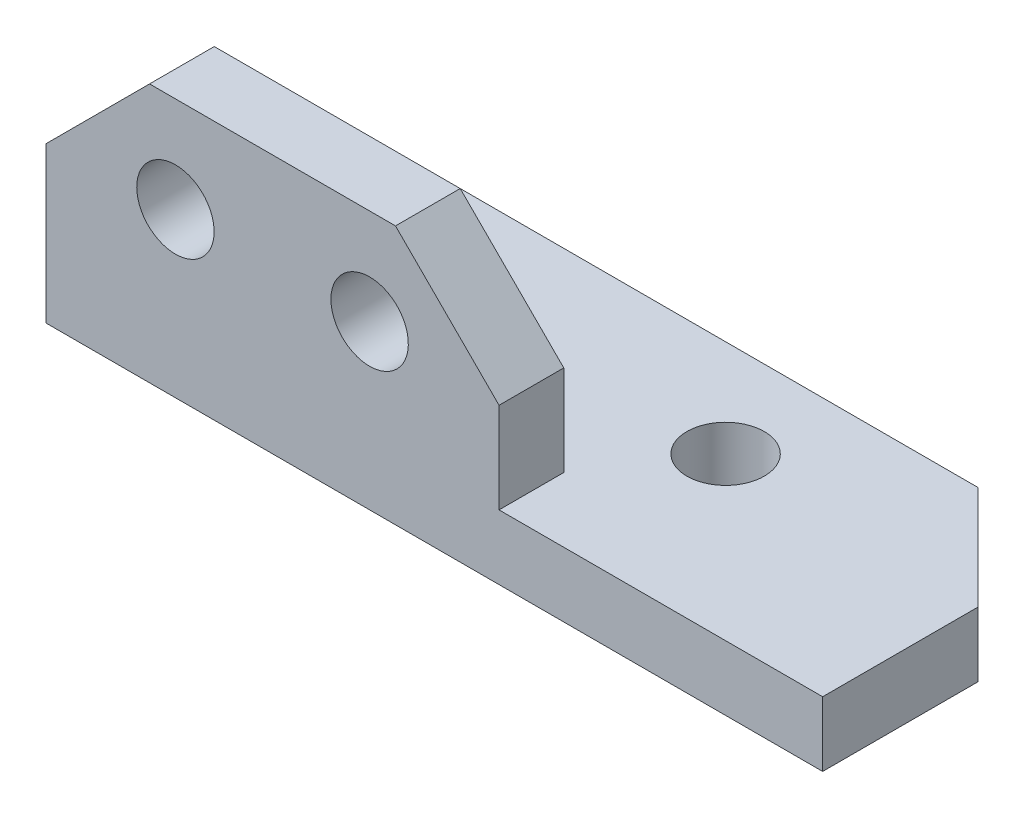
ISO-10303-21;
HEADER;
FILE_DESCRIPTION(('STEP AP214'),'2;1');
FILE_NAME('part.step','',(''),(''),'','','');
FILE_SCHEMA(('AUTOMOTIVE_DESIGN { 1 0 10303 214 1 1 1 1 }'));
ENDSEC;
DATA;
#1=APPLICATION_CONTEXT('core data for automotive mechanical design processes');
#2=APPLICATION_PROTOCOL_DEFINITION('international standard','automotive_design',2000,#1);
#3=PRODUCT_CONTEXT('',#1,'mechanical');
#4=PRODUCT('Part','Part','',(#3));
#5=PRODUCT_RELATED_PRODUCT_CATEGORY('part','',(#4));
#6=PRODUCT_DEFINITION_FORMATION('','',#4);
#7=PRODUCT_DEFINITION_CONTEXT('part definition',#1,'design');
#8=PRODUCT_DEFINITION('design','',#6,#7);
#9=PRODUCT_DEFINITION_SHAPE('','',#8);
#10=(LENGTH_UNIT() NAMED_UNIT(*) SI_UNIT(.MILLI.,.METRE.));
#11=(NAMED_UNIT(*) PLANE_ANGLE_UNIT() SI_UNIT($,.RADIAN.));
#12=(NAMED_UNIT(*) SI_UNIT($,.STERADIAN.) SOLID_ANGLE_UNIT());
#13=UNCERTAINTY_MEASURE_WITH_UNIT(LENGTH_MEASURE(1.E-05),#10,'distance_accuracy_value','');
#14=(GEOMETRIC_REPRESENTATION_CONTEXT(3) GLOBAL_UNCERTAINTY_ASSIGNED_CONTEXT((#13)) GLOBAL_UNIT_ASSIGNED_CONTEXT((#10,
#11,#12)) REPRESENTATION_CONTEXT('',''));
#15=CARTESIAN_POINT('',(0.,0.,0.));
#16=DIRECTION('',(0.,0.,1.));
#17=DIRECTION('',(1.,0.,0.));
#18=AXIS2_PLACEMENT_3D('',#15,#16,#17);
#19=CARTESIAN_POINT('',(19.05,9.525,0.));
#20=DIRECTION('',(0.,-1.,0.));
#21=DIRECTION('',(0.,0.,-1.));
#22=AXIS2_PLACEMENT_3D('',#19,#20,#21);
#23=PLANE('',#22);
#24=DIRECTION('',(-1.,0.,0.));
#25=VECTOR('',#24,1.);
#26=CARTESIAN_POINT('',(19.05,9.525,0.));
#27=LINE('',#26,#25);
#28=CARTESIAN_POINT('',(-1.905,9.525,0.));
#29=VERTEX_POINT('',#28);
#30=CARTESIAN_POINT('',(-13.97,9.525,0.));
#31=VERTEX_POINT('',#30);
#32=EDGE_CURVE('E135',#29,#31,#27,.T.);
#33=ORIENTED_EDGE('',*,*,#32,.T.);
#34=DIRECTION('',(0.,0.,1.));
#35=VECTOR('',#34,1.);
#36=CARTESIAN_POINT('',(-13.97,9.525,3.175));
#37=LINE('',#36,#35);
#38=CARTESIAN_POINT('',(-13.97,9.525,3.175));
#39=VERTEX_POINT('',#38);
#40=EDGE_CURVE('E181',#31,#39,#37,.T.);
#41=ORIENTED_EDGE('',*,*,#40,.T.);
#42=DIRECTION('',(-1.,0.,0.));
#43=VECTOR('',#42,1.);
#44=CARTESIAN_POINT('',(19.05,9.525,3.175));
#45=LINE('',#44,#43);
#46=CARTESIAN_POINT('',(-1.905,9.525,3.175));
#47=VERTEX_POINT('',#46);
#48=EDGE_CURVE('E150',#47,#39,#45,.T.);
#49=ORIENTED_EDGE('',*,*,#48,.F.);
#50=DIRECTION('',(0.,0.,-1.));
#51=VECTOR('',#50,1.);
#52=CARTESIAN_POINT('',(-1.905,9.525,0.));
#53=LINE('',#52,#51);
#54=EDGE_CURVE('E178',#47,#29,#53,.T.);
#55=ORIENTED_EDGE('',*,*,#54,.T.);
#56=EDGE_LOOP('',(#33,#41,#49,#55));
#57=FACE_BOUND('',#56,.T.);
#58=ADVANCED_FACE('F34',(#57),#23,.F.);
#59=CARTESIAN_POINT('',(19.05,9.525,3.175));
#60=DIRECTION('',(0.,0.,-1.));
#61=DIRECTION('',(0.,1.,0.));
#62=AXIS2_PLACEMENT_3D('',#59,#60,#61);
#63=PLANE('',#62);
#64=CARTESIAN_POINT('',(-12.7,4.826,3.175));
#65=DIRECTION('',(0.,0.,-1.));
#66=DIRECTION('',(0.,1.,0.));
#67=AXIS2_PLACEMENT_3D('',#64,#65,#66);
#68=CIRCLE('',#67,1.89865);
#69=CARTESIAN_POINT('',(-12.7,6.72465,3.175));
#70=VERTEX_POINT('',#69);
#71=EDGE_CURVE('E337',#70,#70,#68,.T.);
#72=ORIENTED_EDGE('',*,*,#71,.T.);
#73=EDGE_LOOP('',(#72));
#74=FACE_BOUND('',#73,.T.);
#75=CARTESIAN_POINT('',(-3.175,4.826,3.175));
#76=DIRECTION('',(0.,0.,-1.));
#77=DIRECTION('',(0.,1.,0.));
#78=AXIS2_PLACEMENT_3D('',#75,#76,#77);
#79=CIRCLE('',#78,1.89865);
#80=CARTESIAN_POINT('',(-3.175,6.72465,3.175));
#81=VERTEX_POINT('',#80);
#82=EDGE_CURVE('E154',#81,#81,#79,.T.);
#83=ORIENTED_EDGE('',*,*,#82,.T.);
#84=EDGE_LOOP('',(#83));
#85=FACE_BOUND('',#84,.T.);
#86=ORIENTED_EDGE('',*,*,#48,.T.);
#87=DIRECTION('',(-0.707106781186546,-0.707106781186549,0.));
#88=VECTOR('',#87,1.);
#89=CARTESIAN_POINT('',(-13.97,9.525,3.175));
#90=LINE('',#89,#88);
#91=CARTESIAN_POINT('',(-19.05,4.44499999999999,3.175));
#92=VERTEX_POINT('',#91);
#93=EDGE_CURVE('E186',#39,#92,#90,.T.);
#94=ORIENTED_EDGE('',*,*,#93,.T.);
#95=DIRECTION('',(0.,-1.,0.));
#96=VECTOR('',#95,1.);
#97=CARTESIAN_POINT('',(-19.05,9.525,3.175));
#98=LINE('',#97,#96);
#99=CARTESIAN_POINT('',(-19.05,-3.175,3.175));
#100=VERTEX_POINT('',#99);
#101=EDGE_CURVE('E157',#92,#100,#98,.T.);
#102=ORIENTED_EDGE('',*,*,#101,.T.);
#103=DIRECTION('',(-1.,0.,0.));
#104=VECTOR('',#103,1.);
#105=CARTESIAN_POINT('',(19.05,-3.175,3.175));
#106=LINE('',#105,#104);
#107=CARTESIAN_POINT('',(19.05,-3.175,3.175));
#108=VERTEX_POINT('',#107);
#109=EDGE_CURVE('E147',#108,#100,#106,.T.);
#110=ORIENTED_EDGE('',*,*,#109,.F.);
#111=DIRECTION('',(0.,-1.,0.));
#112=VECTOR('',#111,1.);
#113=CARTESIAN_POINT('',(19.05,9.525,3.175));
#114=LINE('',#113,#112);
#115=CARTESIAN_POINT('',(19.05,0.,3.175));
#116=VERTEX_POINT('',#115);
#117=EDGE_CURVE('E213',#116,#108,#114,.T.);
#118=ORIENTED_EDGE('',*,*,#117,.F.);
#119=DIRECTION('',(-1.,0.,0.));
#120=VECTOR('',#119,1.);
#121=CARTESIAN_POINT('',(19.05,0.,3.175));
#122=LINE('',#121,#120);
#123=CARTESIAN_POINT('',(3.175,0.,3.175));
#124=VERTEX_POINT('',#123);
#125=EDGE_CURVE('E128',#116,#124,#122,.T.);
#126=ORIENTED_EDGE('',*,*,#125,.T.);
#127=DIRECTION('',(0.,1.,0.));
#128=VECTOR('',#127,1.);
#129=CARTESIAN_POINT('',(3.175,9.525,3.175));
#130=LINE('',#129,#128);
#131=CARTESIAN_POINT('',(3.175,4.44499999999999,3.175));
#132=VERTEX_POINT('',#131);
#133=EDGE_CURVE('E116',#124,#132,#130,.T.);
#134=ORIENTED_EDGE('',*,*,#133,.T.);
#135=DIRECTION('',(0.707106781186546,-0.707106781186549,0.));
#136=VECTOR('',#135,1.);
#137=CARTESIAN_POINT('',(-1.905,9.525,3.175));
#138=LINE('',#137,#136);
#139=EDGE_CURVE('E184',#132,#47,#138,.F.);
#140=ORIENTED_EDGE('',*,*,#139,.T.);
#141=EDGE_LOOP('',(#86,#94,#102,#110,#118,#126,#134,#140));
#142=FACE_BOUND('',#141,.T.);
#143=ADVANCED_FACE('F199',(#74,#85,#142),#63,.F.);
#144=CARTESIAN_POINT('',(19.05,-3.175,3.175));
#145=DIRECTION('',(0.,1.,0.));
#146=DIRECTION('',(0.,0.,1.));
#147=AXIS2_PLACEMENT_3D('',#144,#145,#146);
#148=PLANE('',#147);
#149=CARTESIAN_POINT('',(6.35,-3.175,-4.7625));
#150=DIRECTION('',(0.,1.,0.));
#151=DIRECTION('',(0.,0.,1.));
#152=AXIS2_PLACEMENT_3D('',#149,#150,#151);
#153=CIRCLE('',#152,1.89865);
#154=CARTESIAN_POINT('',(6.35,-3.175,-2.86385));
#155=VERTEX_POINT('',#154);
#156=EDGE_CURVE('E326',#155,#155,#153,.T.);
#157=ORIENTED_EDGE('',*,*,#156,.T.);
#158=EDGE_LOOP('',(#157));
#159=FACE_BOUND('',#158,.T.);
#160=CARTESIAN_POINT('',(-6.35,-3.175,-4.7625));
#161=DIRECTION('',(0.,1.,0.));
#162=DIRECTION('',(0.,0.,1.));
#163=AXIS2_PLACEMENT_3D('',#160,#161,#162);
#164=CIRCLE('',#163,1.89865);
#165=CARTESIAN_POINT('',(-6.35,-3.175,-2.86385));
#166=VERTEX_POINT('',#165);
#167=EDGE_CURVE('E332',#166,#166,#164,.T.);
#168=ORIENTED_EDGE('',*,*,#167,.T.);
#169=EDGE_LOOP('',(#168));
#170=FACE_BOUND('',#169,.T.);
#171=DIRECTION('',(-1.,0.,0.));
#172=VECTOR('',#171,1.);
#173=CARTESIAN_POINT('',(19.05,-3.175,-9.525));
#174=LINE('',#173,#172);
#175=CARTESIAN_POINT('',(13.97,-3.175,-9.525));
#176=VERTEX_POINT('',#175);
#177=CARTESIAN_POINT('',(-13.97,-3.175,-9.525));
#178=VERTEX_POINT('',#177);
#179=EDGE_CURVE('E138',#176,#178,#174,.T.);
#180=ORIENTED_EDGE('',*,*,#179,.F.);
#181=DIRECTION('',(-0.707106781186549,0.,-0.707106781186546));
#182=VECTOR('',#181,1.);
#183=CARTESIAN_POINT('',(19.05,-3.175,-4.44500000000001));
#184=LINE('',#183,#182);
#185=CARTESIAN_POINT('',(19.05,-3.175,-4.44500000000001));
#186=VERTEX_POINT('',#185);
#187=EDGE_CURVE('E172',#176,#186,#184,.F.);
#188=ORIENTED_EDGE('',*,*,#187,.T.);
#189=DIRECTION('',(0.,0.,-1.));
#190=VECTOR('',#189,1.);
#191=CARTESIAN_POINT('',(19.05,-3.175,3.175));
#192=LINE('',#191,#190);
#193=EDGE_CURVE('E215',#108,#186,#192,.T.);
#194=ORIENTED_EDGE('',*,*,#193,.F.);
#195=ORIENTED_EDGE('',*,*,#109,.T.);
#196=DIRECTION('',(0.,0.,-1.));
#197=VECTOR('',#196,1.);
#198=CARTESIAN_POINT('',(-19.05,-3.175,3.175));
#199=LINE('',#198,#197);
#200=CARTESIAN_POINT('',(-19.05,-3.175,-4.44499999999999));
#201=VERTEX_POINT('',#200);
#202=EDGE_CURVE('E205',#100,#201,#199,.T.);
#203=ORIENTED_EDGE('',*,*,#202,.T.);
#204=DIRECTION('',(0.707106781186546,0.,-0.707106781186549));
#205=VECTOR('',#204,1.);
#206=CARTESIAN_POINT('',(-13.97,-3.175,-9.525));
#207=LINE('',#206,#205);
#208=EDGE_CURVE('E170',#201,#178,#207,.T.);
#209=ORIENTED_EDGE('',*,*,#208,.T.);
#210=EDGE_LOOP('',(#180,#188,#194,#195,#203,#209));
#211=FACE_BOUND('',#210,.T.);
#212=ADVANCED_FACE('F225',(#159,#170,#211),#148,.F.);
#213=CARTESIAN_POINT('',(19.05,-3.175,-9.525));
#214=DIRECTION('',(0.,0.,1.));
#215=DIRECTION('',(1.,0.,0.));
#216=AXIS2_PLACEMENT_3D('',#213,#214,#215);
#217=PLANE('',#216);
#218=DIRECTION('',(-1.,0.,0.));
#219=VECTOR('',#218,1.);
#220=CARTESIAN_POINT('',(19.05,0.,-9.525));
#221=LINE('',#220,#219);
#222=CARTESIAN_POINT('',(13.97,0.,-9.525));
#223=VERTEX_POINT('',#222);
#224=CARTESIAN_POINT('',(-13.97,0.,-9.525));
#225=VERTEX_POINT('',#224);
#226=EDGE_CURVE('E134',#223,#225,#221,.T.);
#227=ORIENTED_EDGE('',*,*,#226,.F.);
#228=DIRECTION('',(0.,-1.,0.));
#229=VECTOR('',#228,1.);
#230=CARTESIAN_POINT('',(13.97,-3.175,-9.525));
#231=LINE('',#230,#229);
#232=EDGE_CURVE('E168',#223,#176,#231,.T.);
#233=ORIENTED_EDGE('',*,*,#232,.T.);
#234=ORIENTED_EDGE('',*,*,#179,.T.);
#235=DIRECTION('',(0.,1.,0.));
#236=VECTOR('',#235,1.);
#237=CARTESIAN_POINT('',(-13.97,0.,-9.525));
#238=LINE('',#237,#236);
#239=EDGE_CURVE('E165',#178,#225,#238,.T.);
#240=ORIENTED_EDGE('',*,*,#239,.T.);
#241=EDGE_LOOP('',(#227,#233,#234,#240));
#242=FACE_BOUND('',#241,.T.);
#243=ADVANCED_FACE('F232',(#242),#217,.F.);
#244=CARTESIAN_POINT('',(19.05,0.,-9.525));
#245=DIRECTION('',(0.,-1.,0.));
#246=DIRECTION('',(0.,0.,-1.));
#247=AXIS2_PLACEMENT_3D('',#244,#245,#246);
#248=PLANE('',#247);
#249=CARTESIAN_POINT('',(6.35,0.,-4.7625));
#250=DIRECTION('',(0.,1.,0.));
#251=DIRECTION('',(0.,0.,1.));
#252=AXIS2_PLACEMENT_3D('',#249,#250,#251);
#253=CIRCLE('',#252,1.89865);
#254=CARTESIAN_POINT('',(6.35,0.,-2.86385));
#255=VERTEX_POINT('',#254);
#256=EDGE_CURVE('E121',#255,#255,#253,.T.);
#257=ORIENTED_EDGE('',*,*,#256,.F.);
#258=EDGE_LOOP('',(#257));
#259=FACE_BOUND('',#258,.T.);
#260=CARTESIAN_POINT('',(-6.35,0.,-4.7625));
#261=DIRECTION('',(0.,1.,0.));
#262=DIRECTION('',(0.,0.,1.));
#263=AXIS2_PLACEMENT_3D('',#260,#261,#262);
#264=CIRCLE('',#263,1.89865);
#265=CARTESIAN_POINT('',(-6.35,0.,-2.86385));
#266=VERTEX_POINT('',#265);
#267=EDGE_CURVE('E329',#266,#266,#264,.T.);
#268=ORIENTED_EDGE('',*,*,#267,.F.);
#269=EDGE_LOOP('',(#268));
#270=FACE_BOUND('',#269,.T.);
#271=DIRECTION('',(0.,0.,1.));
#272=VECTOR('',#271,1.);
#273=CARTESIAN_POINT('',(19.05,0.,-9.525));
#274=LINE('',#273,#272);
#275=CARTESIAN_POINT('',(19.05,0.,-4.44500000000001));
#276=VERTEX_POINT('',#275);
#277=EDGE_CURVE('E141',#276,#116,#274,.T.);
#278=ORIENTED_EDGE('',*,*,#277,.F.);
#279=DIRECTION('',(0.707106781186549,0.,0.707106781186546));
#280=VECTOR('',#279,1.);
#281=CARTESIAN_POINT('',(19.05,0.,-4.44500000000001));
#282=LINE('',#281,#280);
#283=EDGE_CURVE('E163',#276,#223,#282,.F.);
#284=ORIENTED_EDGE('',*,*,#283,.T.);
#285=ORIENTED_EDGE('',*,*,#226,.T.);
#286=DIRECTION('',(-0.707106781186546,0.,0.707106781186549));
#287=VECTOR('',#286,1.);
#288=CARTESIAN_POINT('',(-13.97,0.,-9.525));
#289=LINE('',#288,#287);
#290=CARTESIAN_POINT('',(-19.05,0.,-4.44499999999999));
#291=VERTEX_POINT('',#290);
#292=EDGE_CURVE('E161',#225,#291,#289,.T.);
#293=ORIENTED_EDGE('',*,*,#292,.T.);
#294=DIRECTION('',(0.,0.,1.));
#295=VECTOR('',#294,1.);
#296=CARTESIAN_POINT('',(-19.05,0.,-9.525));
#297=LINE('',#296,#295);
#298=CARTESIAN_POINT('',(-19.05,0.,0.));
#299=VERTEX_POINT('',#298);
#300=EDGE_CURVE('E133',#291,#299,#297,.T.);
#301=ORIENTED_EDGE('',*,*,#300,.T.);
#302=DIRECTION('',(-1.,0.,0.));
#303=VECTOR('',#302,1.);
#304=CARTESIAN_POINT('',(19.05,0.,0.));
#305=LINE('',#304,#303);
#306=CARTESIAN_POINT('',(3.175,0.,0.));
#307=VERTEX_POINT('',#306);
#308=EDGE_CURVE('E126',#307,#299,#305,.T.);
#309=ORIENTED_EDGE('',*,*,#308,.F.);
#310=DIRECTION('',(0.,0.,-1.));
#311=VECTOR('',#310,1.);
#312=CARTESIAN_POINT('',(3.175,0.,3.175));
#313=LINE('',#312,#311);
#314=EDGE_CURVE('E113',#124,#307,#313,.T.);
#315=ORIENTED_EDGE('',*,*,#314,.F.);
#316=ORIENTED_EDGE('',*,*,#125,.F.);
#317=EDGE_LOOP('',(#278,#284,#285,#293,#301,#309,#315,#316));
#318=FACE_BOUND('',#317,.T.);
#319=ADVANCED_FACE('F131',(#259,#270,#318),#248,.F.);
#320=CARTESIAN_POINT('',(19.05,0.,0.));
#321=DIRECTION('',(0.,0.,1.));
#322=DIRECTION('',(1.,0.,0.));
#323=AXIS2_PLACEMENT_3D('',#320,#321,#322);
#324=PLANE('',#323);
#325=CARTESIAN_POINT('',(-12.7,4.826,0.));
#326=DIRECTION('',(0.,0.,-1.));
#327=DIRECTION('',(-1.,0.,0.));
#328=AXIS2_PLACEMENT_3D('',#325,#326,#327);
#329=CIRCLE('',#328,1.89865);
#330=CARTESIAN_POINT('',(-14.59865,4.826,0.));
#331=VERTEX_POINT('',#330);
#332=EDGE_CURVE('E335',#331,#331,#329,.T.);
#333=ORIENTED_EDGE('',*,*,#332,.F.);
#334=EDGE_LOOP('',(#333));
#335=FACE_BOUND('',#334,.T.);
#336=CARTESIAN_POINT('',(-3.175,4.826,0.));
#337=DIRECTION('',(0.,0.,-1.));
#338=DIRECTION('',(-1.,0.,0.));
#339=AXIS2_PLACEMENT_3D('',#336,#337,#338);
#340=CIRCLE('',#339,1.89865);
#341=CARTESIAN_POINT('',(-5.07365,4.826,0.));
#342=VERTEX_POINT('',#341);
#343=EDGE_CURVE('E158',#342,#342,#340,.T.);
#344=ORIENTED_EDGE('',*,*,#343,.F.);
#345=EDGE_LOOP('',(#344));
#346=FACE_BOUND('',#345,.T.);
#347=DIRECTION('',(0.,1.,0.));
#348=VECTOR('',#347,1.);
#349=CARTESIAN_POINT('',(-19.05,0.,0.));
#350=LINE('',#349,#348);
#351=CARTESIAN_POINT('',(-19.05,4.44499999999999,0.));
#352=VERTEX_POINT('',#351);
#353=EDGE_CURVE('E189',#299,#352,#350,.T.);
#354=ORIENTED_EDGE('',*,*,#353,.T.);
#355=DIRECTION('',(0.707106781186546,0.707106781186549,0.));
#356=VECTOR('',#355,1.);
#357=CARTESIAN_POINT('',(-13.97,9.525,0.));
#358=LINE('',#357,#356);
#359=EDGE_CURVE('E41',#352,#31,#358,.T.);
#360=ORIENTED_EDGE('',*,*,#359,.T.);
#361=ORIENTED_EDGE('',*,*,#32,.F.);
#362=DIRECTION('',(-0.707106781186546,0.707106781186549,0.));
#363=VECTOR('',#362,1.);
#364=CARTESIAN_POINT('',(-1.905,9.525,0.));
#365=LINE('',#364,#363);
#366=CARTESIAN_POINT('',(3.175,4.44499999999999,0.));
#367=VERTEX_POINT('',#366);
#368=EDGE_CURVE('E48',#29,#367,#365,.F.);
#369=ORIENTED_EDGE('',*,*,#368,.T.);
#370=DIRECTION('',(0.,1.,0.));
#371=VECTOR('',#370,1.);
#372=CARTESIAN_POINT('',(3.175,9.525,0.));
#373=LINE('',#372,#371);
#374=EDGE_CURVE('E115',#307,#367,#373,.T.);
#375=ORIENTED_EDGE('',*,*,#374,.F.);
#376=ORIENTED_EDGE('',*,*,#308,.T.);
#377=EDGE_LOOP('',(#354,#360,#361,#369,#375,#376));
#378=FACE_BOUND('',#377,.T.);
#379=ADVANCED_FACE('F125',(#335,#346,#378),#324,.F.);
#380=CARTESIAN_POINT('',(19.05,9.525,-9.525));
#381=DIRECTION('',(-1.,0.,0.));
#382=DIRECTION('',(0.,0.,1.));
#383=AXIS2_PLACEMENT_3D('',#380,#381,#382);
#384=PLANE('',#383);
#385=ORIENTED_EDGE('',*,*,#193,.T.);
#386=DIRECTION('',(0.,1.,0.));
#387=VECTOR('',#386,1.);
#388=CARTESIAN_POINT('',(19.05,9.525,-4.44500000000001));
#389=LINE('',#388,#387);
#390=EDGE_CURVE('E153',#186,#276,#389,.T.);
#391=ORIENTED_EDGE('',*,*,#390,.T.);
#392=ORIENTED_EDGE('',*,*,#277,.T.);
#393=ORIENTED_EDGE('',*,*,#117,.T.);
#394=EDGE_LOOP('',(#385,#391,#392,#393));
#395=FACE_BOUND('',#394,.T.);
#396=ADVANCED_FACE('F218',(#395),#384,.F.);
#397=CARTESIAN_POINT('',(-19.05,9.525,-9.525));
#398=DIRECTION('',(-1.,0.,0.));
#399=DIRECTION('',(0.,0.,1.));
#400=AXIS2_PLACEMENT_3D('',#397,#398,#399);
#401=PLANE('',#400);
#402=ORIENTED_EDGE('',*,*,#300,.F.);
#403=DIRECTION('',(0.,-1.,0.));
#404=VECTOR('',#403,1.);
#405=CARTESIAN_POINT('',(-19.05,-3.175,-4.44499999999999));
#406=LINE('',#405,#404);
#407=EDGE_CURVE('E176',#291,#201,#406,.T.);
#408=ORIENTED_EDGE('',*,*,#407,.T.);
#409=ORIENTED_EDGE('',*,*,#202,.F.);
#410=ORIENTED_EDGE('',*,*,#101,.F.);
#411=DIRECTION('',(0.,0.,-1.));
#412=VECTOR('',#411,1.);
#413=CARTESIAN_POINT('',(-19.05,4.44499999999999,0.));
#414=LINE('',#413,#412);
#415=EDGE_CURVE('E174',#92,#352,#414,.T.);
#416=ORIENTED_EDGE('',*,*,#415,.T.);
#417=ORIENTED_EDGE('',*,*,#353,.F.);
#418=EDGE_LOOP('',(#402,#408,#409,#410,#416,#417));
#419=FACE_BOUND('',#418,.T.);
#420=ADVANCED_FACE('F203',(#419),#401,.T.);
#421=CARTESIAN_POINT('',(-3.175,4.826,0.));
#422=DIRECTION('',(0.,0.,-1.));
#423=DIRECTION('',(-1.,0.,0.));
#424=AXIS2_PLACEMENT_3D('',#421,#422,#423);
#425=CYLINDRICAL_SURFACE('',#424,1.89865);
#426=ORIENTED_EDGE('',*,*,#343,.T.);
#427=EDGE_LOOP('',(#426));
#428=FACE_BOUND('',#427,.T.);
#429=ORIENTED_EDGE('',*,*,#82,.F.);
#430=EDGE_LOOP('',(#429));
#431=FACE_BOUND('',#430,.T.);
#432=ADVANCED_FACE('F272',(#428,#431),#425,.F.);
#433=CARTESIAN_POINT('',(-12.7,4.826,0.));
#434=DIRECTION('',(0.,0.,-1.));
#435=DIRECTION('',(-1.,0.,0.));
#436=AXIS2_PLACEMENT_3D('',#433,#434,#435);
#437=CYLINDRICAL_SURFACE('',#436,1.89865);
#438=ORIENTED_EDGE('',*,*,#332,.T.);
#439=EDGE_LOOP('',(#438));
#440=FACE_BOUND('',#439,.T.);
#441=ORIENTED_EDGE('',*,*,#71,.F.);
#442=EDGE_LOOP('',(#441));
#443=FACE_BOUND('',#442,.T.);
#444=ADVANCED_FACE('F275',(#440,#443),#437,.F.);
#445=CARTESIAN_POINT('',(-6.35,0.,-4.7625));
#446=DIRECTION('',(0.,1.,0.));
#447=DIRECTION('',(0.,0.,1.));
#448=AXIS2_PLACEMENT_3D('',#445,#446,#447);
#449=CYLINDRICAL_SURFACE('',#448,1.89865);
#450=ORIENTED_EDGE('',*,*,#267,.T.);
#451=EDGE_LOOP('',(#450));
#452=FACE_BOUND('',#451,.T.);
#453=ORIENTED_EDGE('',*,*,#167,.F.);
#454=EDGE_LOOP('',(#453));
#455=FACE_BOUND('',#454,.T.);
#456=ADVANCED_FACE('F279',(#452,#455),#449,.F.);
#457=CARTESIAN_POINT('',(6.35,0.,-4.7625));
#458=DIRECTION('',(0.,1.,0.));
#459=DIRECTION('',(0.,0.,1.));
#460=AXIS2_PLACEMENT_3D('',#457,#458,#459);
#461=CYLINDRICAL_SURFACE('',#460,1.89865);
#462=ORIENTED_EDGE('',*,*,#256,.T.);
#463=EDGE_LOOP('',(#462));
#464=FACE_BOUND('',#463,.T.);
#465=ORIENTED_EDGE('',*,*,#156,.F.);
#466=EDGE_LOOP('',(#465));
#467=FACE_BOUND('',#466,.T.);
#468=ADVANCED_FACE('F283',(#464,#467),#461,.F.);
#469=CARTESIAN_POINT('',(3.175,9.525,3.175));
#470=DIRECTION('',(-1.,0.,0.));
#471=DIRECTION('',(0.,0.,1.));
#472=AXIS2_PLACEMENT_3D('',#469,#470,#471);
#473=PLANE('',#472);
#474=ORIENTED_EDGE('',*,*,#374,.T.);
#475=DIRECTION('',(0.,0.,1.));
#476=VECTOR('',#475,1.);
#477=CARTESIAN_POINT('',(3.175,4.44499999999999,3.175));
#478=LINE('',#477,#476);
#479=EDGE_CURVE('E11',#367,#132,#478,.T.);
#480=ORIENTED_EDGE('',*,*,#479,.T.);
#481=ORIENTED_EDGE('',*,*,#133,.F.);
#482=ORIENTED_EDGE('',*,*,#314,.T.);
#483=EDGE_LOOP('',(#474,#480,#481,#482));
#484=FACE_BOUND('',#483,.T.);
#485=ADVANCED_FACE('F114',(#484),#473,.F.);
#486=CARTESIAN_POINT('',(19.05,9.525,-4.44500000000001));
#487=DIRECTION('',(-0.707106781186546,0.,0.707106781186549));
#488=DIRECTION('',(0.707106781186549,0.,0.707106781186546));
#489=AXIS2_PLACEMENT_3D('',#486,#487,#488);
#490=PLANE('',#489);
#491=ORIENTED_EDGE('',*,*,#187,.F.);
#492=ORIENTED_EDGE('',*,*,#232,.F.);
#493=ORIENTED_EDGE('',*,*,#283,.F.);
#494=ORIENTED_EDGE('',*,*,#390,.F.);
#495=EDGE_LOOP('',(#491,#492,#493,#494));
#496=FACE_BOUND('',#495,.T.);
#497=ADVANCED_FACE('F228',(#496),#490,.F.);
#498=CARTESIAN_POINT('',(-13.97,-3.175,-9.525));
#499=DIRECTION('',(-0.707106781186549,0.,-0.707106781186546));
#500=DIRECTION('',(-0.707106781186546,0.,0.707106781186549));
#501=AXIS2_PLACEMENT_3D('',#498,#499,#500);
#502=PLANE('',#501);
#503=ORIENTED_EDGE('',*,*,#208,.F.);
#504=ORIENTED_EDGE('',*,*,#407,.F.);
#505=ORIENTED_EDGE('',*,*,#292,.F.);
#506=ORIENTED_EDGE('',*,*,#239,.F.);
#507=EDGE_LOOP('',(#503,#504,#505,#506));
#508=FACE_BOUND('',#507,.T.);
#509=ADVANCED_FACE('F236',(#508),#502,.T.);
#510=CARTESIAN_POINT('',(-13.97,9.525,0.));
#511=DIRECTION('',(-0.707106781186549,0.707106781186546,0.));
#512=DIRECTION('',(-0.707106781186546,-0.707106781186549,0.));
#513=AXIS2_PLACEMENT_3D('',#510,#511,#512);
#514=PLANE('',#513);
#515=ORIENTED_EDGE('',*,*,#359,.F.);
#516=ORIENTED_EDGE('',*,*,#415,.F.);
#517=ORIENTED_EDGE('',*,*,#93,.F.);
#518=ORIENTED_EDGE('',*,*,#40,.F.);
#519=EDGE_LOOP('',(#515,#516,#517,#518));
#520=FACE_BOUND('',#519,.T.);
#521=ADVANCED_FACE('F196',(#520),#514,.T.);
#522=CARTESIAN_POINT('',(-1.905,9.525,0.));
#523=DIRECTION('',(-0.707106781186549,-0.707106781186546,0.));
#524=DIRECTION('',(0.707106781186546,-0.707106781186549,0.));
#525=AXIS2_PLACEMENT_3D('',#522,#523,#524);
#526=PLANE('',#525);
#527=ORIENTED_EDGE('',*,*,#139,.F.);
#528=ORIENTED_EDGE('',*,*,#479,.F.);
#529=ORIENTED_EDGE('',*,*,#368,.F.);
#530=ORIENTED_EDGE('',*,*,#54,.F.);
#531=EDGE_LOOP('',(#527,#528,#529,#530));
#532=FACE_BOUND('',#531,.T.);
#533=ADVANCED_FACE('F244',(#532),#526,.F.);
#534=CLOSED_SHELL('',(#58,#143,#212,#243,#319,#379,#396,#420,#432,#444,#456,#468,#485,#497,#509,
#521,#533));
#535=MANIFOLD_SOLID_BREP('B2',#534);
#536=ADVANCED_BREP_SHAPE_REPRESENTATION('',(#18,#535),#14);
#537=SHAPE_DEFINITION_REPRESENTATION(#9,#536);
ENDSEC;
END-ISO-10303-21;
